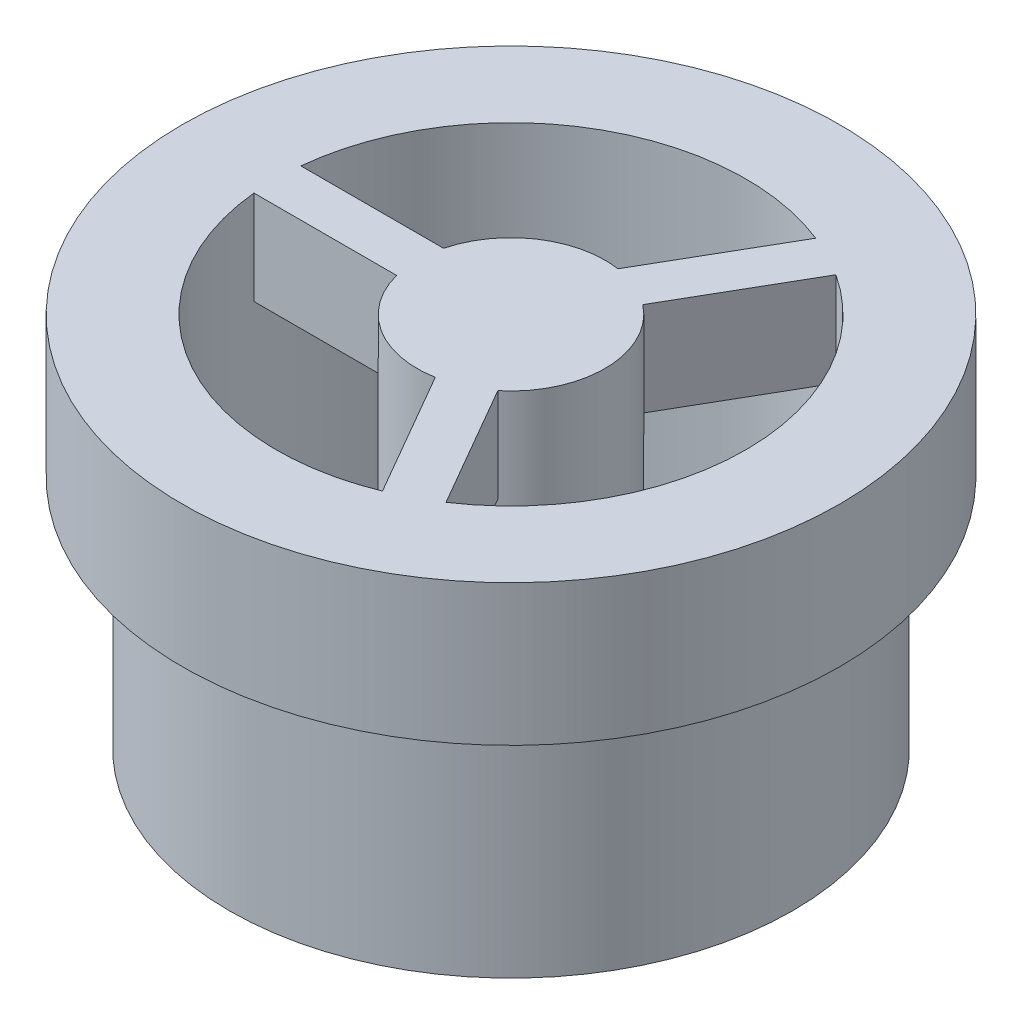
ISO-10303-21;
HEADER;
FILE_DESCRIPTION(('STEP AP214'),'2;1');
FILE_NAME('part.step','',(''),(''),'','','');
FILE_SCHEMA(('AUTOMOTIVE_DESIGN { 1 0 10303 214 1 1 1 1 }'));
ENDSEC;
DATA;
#1=APPLICATION_CONTEXT('core data for automotive mechanical design processes');
#2=APPLICATION_PROTOCOL_DEFINITION('international standard','automotive_design',2000,#1);
#3=PRODUCT_CONTEXT('',#1,'mechanical');
#4=PRODUCT('Part','Part','',(#3));
#5=PRODUCT_RELATED_PRODUCT_CATEGORY('part','',(#4));
#6=PRODUCT_DEFINITION_FORMATION('','',#4);
#7=PRODUCT_DEFINITION_CONTEXT('part definition',#1,'design');
#8=PRODUCT_DEFINITION('design','',#6,#7);
#9=PRODUCT_DEFINITION_SHAPE('','',#8);
#10=(LENGTH_UNIT() NAMED_UNIT(*) SI_UNIT(.MILLI.,.METRE.));
#11=(NAMED_UNIT(*) PLANE_ANGLE_UNIT() SI_UNIT($,.RADIAN.));
#12=(NAMED_UNIT(*) SI_UNIT($,.STERADIAN.) SOLID_ANGLE_UNIT());
#13=UNCERTAINTY_MEASURE_WITH_UNIT(LENGTH_MEASURE(1.E-05),#10,'distance_accuracy_value','');
#14=(GEOMETRIC_REPRESENTATION_CONTEXT(3) GLOBAL_UNCERTAINTY_ASSIGNED_CONTEXT((#13)) GLOBAL_UNIT_ASSIGNED_CONTEXT((#10,
#11,#12)) REPRESENTATION_CONTEXT('',''));
#15=CARTESIAN_POINT('',(0.,0.,0.));
#16=DIRECTION('',(0.,0.,1.));
#17=DIRECTION('',(1.,0.,0.));
#18=AXIS2_PLACEMENT_3D('',#15,#16,#17);
#19=CARTESIAN_POINT('',(-5.,3.,0.));
#20=DIRECTION('',(0.,-1.,0.));
#21=DIRECTION('',(1.,0.,0.));
#22=AXIS2_PLACEMENT_3D('',#19,#20,#21);
#23=PLANE('',#22);
#24=CARTESIAN_POINT('',(0.,3.,0.));
#25=DIRECTION('',(0.,-1.,0.));
#26=DIRECTION('',(0.,0.,-1.));
#27=AXIS2_PLACEMENT_3D('',#24,#25,#26);
#28=CIRCLE('',#27,2.);
#29=CARTESIAN_POINT('',(0.,3.,-2.));
#30=VERTEX_POINT('',#29);
#31=EDGE_CURVE('E118',#30,#30,#28,.F.);
#32=ORIENTED_EDGE('',*,*,#31,.F.);
#33=EDGE_LOOP('',(#32));
#34=FACE_BOUND('',#33,.T.);
#35=ADVANCED_FACE('F17',(#34),#23,.T.);
#36=CARTESIAN_POINT('',(-7.,5.,0.));
#37=DIRECTION('',(0.,-1.,0.));
#38=DIRECTION('',(1.,0.,0.));
#39=AXIS2_PLACEMENT_3D('',#36,#37,#38);
#40=PLANE('',#39);
#41=CARTESIAN_POINT('',(0.,5.,0.));
#42=DIRECTION('',(0.,1.,0.));
#43=DIRECTION('',(-1.,0.,0.));
#44=AXIS2_PLACEMENT_3D('',#41,#42,#43);
#45=CIRCLE('',#44,7.);
#46=CARTESIAN_POINT('',(-7.,5.,0.));
#47=VERTEX_POINT('',#46);
#48=EDGE_CURVE('E190',#47,#47,#45,.T.);
#49=ORIENTED_EDGE('',*,*,#48,.F.);
#50=EDGE_LOOP('',(#49));
#51=FACE_BOUND('',#50,.T.);
#52=CARTESIAN_POINT('',(0.,5.,0.));
#53=DIRECTION('',(0.,1.,0.));
#54=DIRECTION('',(-1.,0.,0.));
#55=AXIS2_PLACEMENT_3D('',#52,#53,#54);
#56=CIRCLE('',#55,6.);
#57=CARTESIAN_POINT('',(-6.,5.,0.));
#58=VERTEX_POINT('',#57);
#59=EDGE_CURVE('E129',#58,#58,#56,.F.);
#60=ORIENTED_EDGE('',*,*,#59,.F.);
#61=EDGE_LOOP('',(#60));
#62=FACE_BOUND('',#61,.T.);
#63=ADVANCED_FACE('F383',(#51,#62),#40,.T.);
#64=CARTESIAN_POINT('',(0.,6.,0.));
#65=DIRECTION('',(0.,-1.,0.));
#66=DIRECTION('',(1.,0.,0.));
#67=AXIS2_PLACEMENT_3D('',#64,#65,#66);
#68=PLANE('',#67);
#69=DIRECTION('',(0.499999999999999,0.,-0.866025403784439));
#70=VECTOR('',#69,1.);
#71=CARTESIAN_POINT('',(1.84010475798465,6.,-4.64908748892105));
#72=LINE('',#71,#70);
#73=CARTESIAN_POINT('',(0.297782593735508,6.,-1.97770713880194));
#74=VERTEX_POINT('',#73);
#75=CARTESIAN_POINT('',(1.84010475798465,6.,-4.64908748892105));
#76=VERTEX_POINT('',#75);
#77=EDGE_CURVE('E126',#74,#76,#72,.T.);
#78=ORIENTED_EDGE('',*,*,#77,.T.);
#79=CARTESIAN_POINT('',(0.,6.,0.));
#80=DIRECTION('',(0.,1.,0.));
#81=DIRECTION('',(-1.,0.,0.));
#82=AXIS2_PLACEMENT_3D('',#79,#80,#81);
#83=CIRCLE('',#82,5.);
#84=CARTESIAN_POINT('',(2.72936845702576,6.,-4.18933739698688));
#85=VERTEX_POINT('',#84);
#86=EDGE_CURVE('E20',#76,#85,#83,.F.);
#87=ORIENTED_EDGE('',*,*,#86,.T.);
#88=DIRECTION('',(-0.499999999999999,0.,0.866025403784439));
#89=VECTOR('',#88,1.);
#90=CARTESIAN_POINT('',(1.22390134225421,6.,-1.58179186507844));
#91=LINE('',#90,#89);
#92=CARTESIAN_POINT('',(1.22390134225421,6.,-1.58179186507844));
#93=VERTEX_POINT('',#92);
#94=EDGE_CURVE('E146',#85,#93,#91,.T.);
#95=ORIENTED_EDGE('',*,*,#94,.T.);
#96=CARTESIAN_POINT('',(0.,6.,0.));
#97=DIRECTION('',(0.,-1.,0.));
#98=DIRECTION('',(0.,0.,-1.));
#99=AXIS2_PLACEMENT_3D('',#96,#97,#98);
#100=CIRCLE('',#99,2.);
#101=EDGE_CURVE('E195',#74,#93,#100,.T.);
#102=ORIENTED_EDGE('',*,*,#101,.F.);
#103=EDGE_LOOP('',(#78,#87,#95,#102));
#104=FACE_BOUND('',#103,.T.);
#105=ADVANCED_FACE('F203',(#104),#68,.T.);
#106=CARTESIAN_POINT('',(0.,6.,0.));
#107=DIRECTION('',(0.,-1.,0.));
#108=DIRECTION('',(1.,0.,0.));
#109=AXIS2_PLACEMENT_3D('',#106,#107,#108);
#110=PLANE('',#109);
#111=DIRECTION('',(0.5,0.,0.866025403784439));
#112=VECTOR('',#111,1.);
#113=CARTESIAN_POINT('',(2.77500712191118,6.,4.15924698393137));
#114=LINE('',#113,#112);
#115=CARTESIAN_POINT('',(1.26707187795723,6.,1.54742652687936));
#116=VERTEX_POINT('',#115);
#117=CARTESIAN_POINT('',(2.77500712191118,6.,4.15924698393137));
#118=VERTEX_POINT('',#117);
#119=EDGE_CURVE('E150',#116,#118,#114,.T.);
#120=ORIENTED_EDGE('',*,*,#119,.T.);
#121=CARTESIAN_POINT('',(0.,6.,0.));
#122=DIRECTION('',(0.,1.,0.));
#123=DIRECTION('',(-1.,0.,0.));
#124=AXIS2_PLACEMENT_3D('',#121,#122,#123);
#125=CIRCLE('',#124,5.);
#126=CARTESIAN_POINT('',(1.89124190213249,6.,4.6285207213124));
#127=VERTEX_POINT('',#126);
#128=EDGE_CURVE('E196',#118,#127,#125,.F.);
#129=ORIENTED_EDGE('',*,*,#128,.T.);
#130=DIRECTION('',(-0.5,0.,-0.866025403784439));
#131=VECTOR('',#130,1.);
#132=CARTESIAN_POINT('',(0.355297991636209,6.,1.96818783075683));
#133=LINE('',#132,#131);
#134=CARTESIAN_POINT('',(0.355297991636209,6.,1.96818783075683));
#135=VERTEX_POINT('',#134);
#136=EDGE_CURVE('E154',#127,#135,#133,.T.);
#137=ORIENTED_EDGE('',*,*,#136,.T.);
#138=CARTESIAN_POINT('',(0.,6.,0.));
#139=DIRECTION('',(0.,-1.,0.));
#140=DIRECTION('',(0.,0.,-1.));
#141=AXIS2_PLACEMENT_3D('',#138,#139,#140);
#142=CIRCLE('',#141,2.);
#143=EDGE_CURVE('E193',#116,#135,#142,.T.);
#144=ORIENTED_EDGE('',*,*,#143,.F.);
#145=EDGE_LOOP('',(#120,#129,#137,#144));
#146=FACE_BOUND('',#145,.T.);
#147=ADVANCED_FACE('F236',(#146),#110,.T.);
#148=CARTESIAN_POINT('',(0.,6.5,0.));
#149=DIRECTION('',(0.,1.,0.));
#150=DIRECTION('',(-1.,0.,0.));
#151=AXIS2_PLACEMENT_3D('',#148,#149,#150);
#152=CYLINDRICAL_SURFACE('',#151,7.);
#153=ORIENTED_EDGE('',*,*,#48,.T.);
#154=EDGE_LOOP('',(#153));
#155=FACE_BOUND('',#154,.T.);
#156=CARTESIAN_POINT('',(0.,8.,0.));
#157=DIRECTION('',(0.,1.,0.));
#158=DIRECTION('',(-1.,0.,0.));
#159=AXIS2_PLACEMENT_3D('',#156,#157,#158);
#160=CIRCLE('',#159,7.);
#161=CARTESIAN_POINT('',(-7.,8.,0.));
#162=VERTEX_POINT('',#161);
#163=EDGE_CURVE('E141',#162,#162,#160,.T.);
#164=ORIENTED_EDGE('',*,*,#163,.F.);
#165=EDGE_LOOP('',(#164));
#166=FACE_BOUND('',#165,.T.);
#167=ADVANCED_FACE('F360',(#155,#166),#152,.T.);
#168=CARTESIAN_POINT('',(0.,6.,0.));
#169=DIRECTION('',(0.,-1.,0.));
#170=DIRECTION('',(1.,0.,0.));
#171=AXIS2_PLACEMENT_3D('',#168,#169,#170);
#172=PLANE('',#171);
#173=DIRECTION('',(1.,0.,0.));
#174=VECTOR('',#173,1.);
#175=CARTESIAN_POINT('',(-1.93649167310371,6.,-0.5));
#176=LINE('',#175,#174);
#177=CARTESIAN_POINT('',(-4.9749371855331,6.,-0.5));
#178=VERTEX_POINT('',#177);
#179=CARTESIAN_POINT('',(-1.93649167310371,6.,-0.5));
#180=VERTEX_POINT('',#179);
#181=EDGE_CURVE('E124',#178,#180,#176,.T.);
#182=ORIENTED_EDGE('',*,*,#181,.T.);
#183=CARTESIAN_POINT('',(0.,6.,0.));
#184=DIRECTION('',(0.,-1.,0.));
#185=DIRECTION('',(0.,0.,-1.));
#186=AXIS2_PLACEMENT_3D('',#183,#184,#185);
#187=CIRCLE('',#186,2.);
#188=CARTESIAN_POINT('',(-1.93649167310371,6.,0.5));
#189=VERTEX_POINT('',#188);
#190=EDGE_CURVE('E108',#189,#180,#187,.T.);
#191=ORIENTED_EDGE('',*,*,#190,.F.);
#192=DIRECTION('',(-1.,0.,0.));
#193=VECTOR('',#192,1.);
#194=CARTESIAN_POINT('',(-4.9749371855331,6.,0.500000000000001));
#195=LINE('',#194,#193);
#196=CARTESIAN_POINT('',(-4.9749371855331,6.,0.500000000000001));
#197=VERTEX_POINT('',#196);
#198=EDGE_CURVE('E140',#189,#197,#195,.T.);
#199=ORIENTED_EDGE('',*,*,#198,.T.);
#200=CARTESIAN_POINT('',(0.,6.,0.));
#201=DIRECTION('',(0.,1.,0.));
#202=DIRECTION('',(-1.,0.,0.));
#203=AXIS2_PLACEMENT_3D('',#200,#201,#202);
#204=CIRCLE('',#203,5.);
#205=EDGE_CURVE('E35',#197,#178,#204,.F.);
#206=ORIENTED_EDGE('',*,*,#205,.T.);
#207=EDGE_LOOP('',(#182,#191,#199,#206));
#208=FACE_BOUND('',#207,.T.);
#209=ADVANCED_FACE('F128',(#208),#172,.T.);
#210=CARTESIAN_POINT('',(0.,8.,0.));
#211=DIRECTION('',(0.,-1.,0.));
#212=DIRECTION('',(0.,0.,-1.));
#213=AXIS2_PLACEMENT_3D('',#210,#211,#212);
#214=CYLINDRICAL_SURFACE('',#213,2.);
#215=CARTESIAN_POINT('',(0.,8.,0.));
#216=DIRECTION('',(0.,-1.,0.));
#217=DIRECTION('',(0.,0.,-1.));
#218=AXIS2_PLACEMENT_3D('',#215,#216,#217);
#219=CIRCLE('',#218,2.);
#220=CARTESIAN_POINT('',(-1.93649167310371,8.,0.5));
#221=VERTEX_POINT('',#220);
#222=CARTESIAN_POINT('',(0.355297991636209,8.,1.96818783075683));
#223=VERTEX_POINT('',#222);
#224=EDGE_CURVE('E158',#221,#223,#219,.F.);
#225=ORIENTED_EDGE('',*,*,#224,.F.);
#226=DIRECTION('',(0.,1.,0.));
#227=VECTOR('',#226,1.);
#228=CARTESIAN_POINT('',(-1.93649167310371,8.,0.5));
#229=LINE('',#228,#227);
#230=EDGE_CURVE('E115',#221,#189,#229,.F.);
#231=ORIENTED_EDGE('',*,*,#230,.T.);
#232=ORIENTED_EDGE('',*,*,#190,.T.);
#233=DIRECTION('',(0.,1.,0.));
#234=VECTOR('',#233,1.);
#235=CARTESIAN_POINT('',(-1.93649167310371,8.,-0.5));
#236=LINE('',#235,#234);
#237=CARTESIAN_POINT('',(-1.93649167310371,8.,-0.5));
#238=VERTEX_POINT('',#237);
#239=EDGE_CURVE('E112',#180,#238,#236,.T.);
#240=ORIENTED_EDGE('',*,*,#239,.T.);
#241=CARTESIAN_POINT('',(0.,8.,0.));
#242=DIRECTION('',(0.,-1.,0.));
#243=DIRECTION('',(0.,0.,-1.));
#244=AXIS2_PLACEMENT_3D('',#241,#242,#243);
#245=CIRCLE('',#244,2.);
#246=CARTESIAN_POINT('',(0.297782593735508,8.,-1.97770713880194));
#247=VERTEX_POINT('',#246);
#248=EDGE_CURVE('E179',#247,#238,#245,.F.);
#249=ORIENTED_EDGE('',*,*,#248,.F.);
#250=DIRECTION('',(0.,1.,0.));
#251=VECTOR('',#250,1.);
#252=CARTESIAN_POINT('',(0.297782593735508,8.,-1.97770713880194));
#253=LINE('',#252,#251);
#254=EDGE_CURVE('E143',#247,#74,#253,.F.);
#255=ORIENTED_EDGE('',*,*,#254,.T.);
#256=ORIENTED_EDGE('',*,*,#101,.T.);
#257=DIRECTION('',(0.,1.,0.));
#258=VECTOR('',#257,1.);
#259=CARTESIAN_POINT('',(1.22390134225421,8.,-1.58179186507844));
#260=LINE('',#259,#258);
#261=CARTESIAN_POINT('',(1.22390134225421,8.,-1.58179186507844));
#262=VERTEX_POINT('',#261);
#263=EDGE_CURVE('E147',#93,#262,#260,.T.);
#264=ORIENTED_EDGE('',*,*,#263,.T.);
#265=CARTESIAN_POINT('',(0.,8.,0.));
#266=DIRECTION('',(0.,-1.,0.));
#267=DIRECTION('',(0.,0.,-1.));
#268=AXIS2_PLACEMENT_3D('',#265,#266,#267);
#269=CIRCLE('',#268,2.);
#270=CARTESIAN_POINT('',(1.26707187795723,8.,1.54742652687937));
#271=VERTEX_POINT('',#270);
#272=EDGE_CURVE('E181',#271,#262,#269,.F.);
#273=ORIENTED_EDGE('',*,*,#272,.F.);
#274=DIRECTION('',(0.,1.,0.));
#275=VECTOR('',#274,1.);
#276=CARTESIAN_POINT('',(1.26707187795723,8.,1.54742652687937));
#277=LINE('',#276,#275);
#278=EDGE_CURVE('E151',#271,#116,#277,.F.);
#279=ORIENTED_EDGE('',*,*,#278,.T.);
#280=ORIENTED_EDGE('',*,*,#143,.T.);
#281=DIRECTION('',(0.,1.,0.));
#282=VECTOR('',#281,1.);
#283=CARTESIAN_POINT('',(0.355297991636209,8.,1.96818783075683));
#284=LINE('',#283,#282);
#285=EDGE_CURVE('E155',#135,#223,#284,.T.);
#286=ORIENTED_EDGE('',*,*,#285,.T.);
#287=EDGE_LOOP('',(#225,#231,#232,#240,#249,#255,#256,#264,#273,#279,#280,#286));
#288=FACE_BOUND('',#287,.T.);
#289=ORIENTED_EDGE('',*,*,#31,.T.);
#290=EDGE_LOOP('',(#289));
#291=FACE_BOUND('',#290,.T.);
#292=ADVANCED_FACE('F110',(#288,#291),#214,.T.);
#293=CARTESIAN_POINT('',(0.,2.5,0.));
#294=DIRECTION('',(0.,1.,0.));
#295=DIRECTION('',(-1.,0.,0.));
#296=AXIS2_PLACEMENT_3D('',#293,#294,#295);
#297=CYLINDRICAL_SURFACE('',#296,6.);
#298=ORIENTED_EDGE('',*,*,#59,.T.);
#299=EDGE_LOOP('',(#298));
#300=FACE_BOUND('',#299,.T.);
#301=CARTESIAN_POINT('',(0.,0.,0.));
#302=DIRECTION('',(0.,1.,0.));
#303=DIRECTION('',(-1.,0.,0.));
#304=AXIS2_PLACEMENT_3D('',#301,#302,#303);
#305=CIRCLE('',#304,6.);
#306=CARTESIAN_POINT('',(-6.,0.,0.));
#307=VERTEX_POINT('',#306);
#308=EDGE_CURVE('E138',#307,#307,#305,.F.);
#309=ORIENTED_EDGE('',*,*,#308,.F.);
#310=EDGE_LOOP('',(#309));
#311=FACE_BOUND('',#310,.T.);
#312=ADVANCED_FACE('F260',(#300,#311),#297,.T.);
#313=CARTESIAN_POINT('',(-1.93649167310371,8.,-0.5));
#314=DIRECTION('',(0.,0.,1.));
#315=DIRECTION('',(1.,0.,0.));
#316=AXIS2_PLACEMENT_3D('',#313,#314,#315);
#317=PLANE('',#316);
#318=DIRECTION('',(-1.,0.,0.));
#319=VECTOR('',#318,1.);
#320=CARTESIAN_POINT('',(0.,8.,-0.5));
#321=LINE('',#320,#319);
#322=CARTESIAN_POINT('',(-4.9749371855331,8.,-0.5));
#323=VERTEX_POINT('',#322);
#324=EDGE_CURVE('E125',#238,#323,#321,.T.);
#325=ORIENTED_EDGE('',*,*,#324,.F.);
#326=ORIENTED_EDGE('',*,*,#239,.F.);
#327=ORIENTED_EDGE('',*,*,#181,.F.);
#328=DIRECTION('',(0.,1.,0.));
#329=VECTOR('',#328,1.);
#330=CARTESIAN_POINT('',(-4.9749371855331,1.5,-0.500000000000001));
#331=LINE('',#330,#329);
#332=EDGE_CURVE('E174',#178,#323,#331,.T.);
#333=ORIENTED_EDGE('',*,*,#332,.T.);
#334=EDGE_LOOP('',(#325,#326,#327,#333));
#335=FACE_BOUND('',#334,.T.);
#336=ADVANCED_FACE('F122',(#335),#317,.F.);
#337=CARTESIAN_POINT('',(1.84010475798465,8.,-4.64908748892105));
#338=DIRECTION('',(0.866025403784439,0.,0.499999999999999));
#339=DIRECTION('',(0.499999999999999,0.,-0.866025403784439));
#340=AXIS2_PLACEMENT_3D('',#337,#338,#339);
#341=PLANE('',#340);
#342=DIRECTION('',(-0.499999999999999,0.,0.866025403784439));
#343=VECTOR('',#342,1.);
#344=CARTESIAN_POINT('',(1.84010475798465,8.,-4.64908748892105));
#345=LINE('',#344,#343);
#346=CARTESIAN_POINT('',(1.84010475798465,8.,-4.64908748892105));
#347=VERTEX_POINT('',#346);
#348=EDGE_CURVE('E84',#347,#247,#345,.T.);
#349=ORIENTED_EDGE('',*,*,#348,.F.);
#350=DIRECTION('',(0.,1.,0.));
#351=VECTOR('',#350,1.);
#352=CARTESIAN_POINT('',(1.84010475798465,1.5,-4.64908748892105));
#353=LINE('',#352,#351);
#354=EDGE_CURVE('E135',#347,#76,#353,.F.);
#355=ORIENTED_EDGE('',*,*,#354,.T.);
#356=ORIENTED_EDGE('',*,*,#77,.F.);
#357=ORIENTED_EDGE('',*,*,#254,.F.);
#358=EDGE_LOOP('',(#349,#355,#356,#357));
#359=FACE_BOUND('',#358,.T.);
#360=ADVANCED_FACE('F251',(#359),#341,.F.);
#361=CARTESIAN_POINT('',(1.22390134225421,8.,-1.58179186507844));
#362=DIRECTION('',(-0.866025403784439,0.,-0.499999999999999));
#363=DIRECTION('',(-0.499999999999999,0.,0.866025403784439));
#364=AXIS2_PLACEMENT_3D('',#361,#362,#363);
#365=PLANE('',#364);
#366=DIRECTION('',(0.500000000000001,0.,-0.866025403784438));
#367=VECTOR('',#366,1.);
#368=CARTESIAN_POINT('',(1.22390134225421,8.,-1.58179186507844));
#369=LINE('',#368,#367);
#370=CARTESIAN_POINT('',(2.72936845702576,8.,-4.18933739698688));
#371=VERTEX_POINT('',#370);
#372=EDGE_CURVE('E183',#262,#371,#369,.T.);
#373=ORIENTED_EDGE('',*,*,#372,.F.);
#374=ORIENTED_EDGE('',*,*,#263,.F.);
#375=ORIENTED_EDGE('',*,*,#94,.F.);
#376=DIRECTION('',(0.,1.,0.));
#377=VECTOR('',#376,1.);
#378=CARTESIAN_POINT('',(2.72936845702576,1.5,-4.18933739698688));
#379=LINE('',#378,#377);
#380=EDGE_CURVE('E170',#85,#371,#379,.T.);
#381=ORIENTED_EDGE('',*,*,#380,.T.);
#382=EDGE_LOOP('',(#373,#374,#375,#381));
#383=FACE_BOUND('',#382,.T.);
#384=ADVANCED_FACE('F209',(#383),#365,.F.);
#385=CARTESIAN_POINT('',(2.77500712191118,8.,4.15924698393137));
#386=DIRECTION('',(-0.866025403784439,0.,0.5));
#387=DIRECTION('',(0.5,0.,0.866025403784439));
#388=AXIS2_PLACEMENT_3D('',#385,#386,#387);
#389=PLANE('',#388);
#390=DIRECTION('',(-0.500000000000001,0.,-0.866025403784438));
#391=VECTOR('',#390,1.);
#392=CARTESIAN_POINT('',(2.77500712191118,8.,4.15924698393137));
#393=LINE('',#392,#391);
#394=CARTESIAN_POINT('',(2.77500712191118,8.,4.15924698393137));
#395=VERTEX_POINT('',#394);
#396=EDGE_CURVE('E184',#395,#271,#393,.T.);
#397=ORIENTED_EDGE('',*,*,#396,.F.);
#398=DIRECTION('',(0.,1.,0.));
#399=VECTOR('',#398,1.);
#400=CARTESIAN_POINT('',(2.77500712191118,1.5,4.15924698393137));
#401=LINE('',#400,#399);
#402=EDGE_CURVE('E169',#395,#118,#401,.F.);
#403=ORIENTED_EDGE('',*,*,#402,.T.);
#404=ORIENTED_EDGE('',*,*,#119,.F.);
#405=ORIENTED_EDGE('',*,*,#278,.F.);
#406=EDGE_LOOP('',(#397,#403,#404,#405));
#407=FACE_BOUND('',#406,.T.);
#408=ADVANCED_FACE('F248',(#407),#389,.F.);
#409=CARTESIAN_POINT('',(0.355297991636209,8.,1.96818783075683));
#410=DIRECTION('',(0.866025403784439,0.,-0.5));
#411=DIRECTION('',(-0.5,0.,-0.866025403784439));
#412=AXIS2_PLACEMENT_3D('',#409,#410,#411);
#413=PLANE('',#412);
#414=DIRECTION('',(0.500000000000001,0.,0.866025403784438));
#415=VECTOR('',#414,1.);
#416=CARTESIAN_POINT('',(0.355297991636209,8.,1.96818783075683));
#417=LINE('',#416,#415);
#418=CARTESIAN_POINT('',(1.89124190213249,8.,4.6285207213124));
#419=VERTEX_POINT('',#418);
#420=EDGE_CURVE('E185',#223,#419,#417,.T.);
#421=ORIENTED_EDGE('',*,*,#420,.F.);
#422=ORIENTED_EDGE('',*,*,#285,.F.);
#423=ORIENTED_EDGE('',*,*,#136,.F.);
#424=DIRECTION('',(0.,1.,0.));
#425=VECTOR('',#424,1.);
#426=CARTESIAN_POINT('',(1.89124190213249,1.5,4.6285207213124));
#427=LINE('',#426,#425);
#428=EDGE_CURVE('E165',#127,#419,#427,.T.);
#429=ORIENTED_EDGE('',*,*,#428,.T.);
#430=EDGE_LOOP('',(#421,#422,#423,#429));
#431=FACE_BOUND('',#430,.T.);
#432=ADVANCED_FACE('F241',(#431),#413,.F.);
#433=CARTESIAN_POINT('',(0.,8.,0.));
#434=DIRECTION('',(0.,1.,0.));
#435=DIRECTION('',(-1.,0.,0.));
#436=AXIS2_PLACEMENT_3D('',#433,#434,#435);
#437=PLANE('',#436);
#438=ORIENTED_EDGE('',*,*,#163,.T.);
#439=EDGE_LOOP('',(#438));
#440=FACE_BOUND('',#439,.T.);
#441=ORIENTED_EDGE('',*,*,#248,.T.);
#442=ORIENTED_EDGE('',*,*,#324,.T.);
#443=CARTESIAN_POINT('',(0.,8.,0.));
#444=DIRECTION('',(0.,1.,0.));
#445=DIRECTION('',(-1.,0.,0.));
#446=AXIS2_PLACEMENT_3D('',#443,#444,#445);
#447=CIRCLE('',#446,5.);
#448=EDGE_CURVE('E171',#323,#347,#447,.F.);
#449=ORIENTED_EDGE('',*,*,#448,.T.);
#450=ORIENTED_EDGE('',*,*,#348,.T.);
#451=EDGE_LOOP('',(#441,#442,#449,#450));
#452=FACE_BOUND('',#451,.T.);
#453=ORIENTED_EDGE('',*,*,#272,.T.);
#454=ORIENTED_EDGE('',*,*,#372,.T.);
#455=CARTESIAN_POINT('',(0.,8.,0.));
#456=DIRECTION('',(0.,1.,0.));
#457=DIRECTION('',(-1.,0.,0.));
#458=AXIS2_PLACEMENT_3D('',#455,#456,#457);
#459=CIRCLE('',#458,5.);
#460=EDGE_CURVE('E166',#371,#395,#459,.F.);
#461=ORIENTED_EDGE('',*,*,#460,.T.);
#462=ORIENTED_EDGE('',*,*,#396,.T.);
#463=EDGE_LOOP('',(#453,#454,#461,#462));
#464=FACE_BOUND('',#463,.T.);
#465=CARTESIAN_POINT('',(0.,8.,0.));
#466=DIRECTION('',(0.,1.,0.));
#467=DIRECTION('',(-1.,0.,0.));
#468=AXIS2_PLACEMENT_3D('',#465,#466,#467);
#469=CIRCLE('',#468,5.);
#470=CARTESIAN_POINT('',(-4.9749371855331,8.,0.500000000000001));
#471=VERTEX_POINT('',#470);
#472=EDGE_CURVE('E162',#419,#471,#469,.F.);
#473=ORIENTED_EDGE('',*,*,#472,.T.);
#474=DIRECTION('',(-1.,0.,0.));
#475=VECTOR('',#474,1.);
#476=CARTESIAN_POINT('',(-4.9749371855331,8.,0.500000000000001));
#477=LINE('',#476,#475);
#478=EDGE_CURVE('E139',#471,#221,#477,.F.);
#479=ORIENTED_EDGE('',*,*,#478,.T.);
#480=ORIENTED_EDGE('',*,*,#224,.T.);
#481=ORIENTED_EDGE('',*,*,#420,.T.);
#482=EDGE_LOOP('',(#473,#479,#480,#481));
#483=FACE_BOUND('',#482,.T.);
#484=ADVANCED_FACE('F220',(#440,#452,#464,#483),#437,.T.);
#485=CARTESIAN_POINT('',(-4.9749371855331,8.,0.500000000000001));
#486=DIRECTION('',(0.,0.,-1.));
#487=DIRECTION('',(-1.,0.,0.));
#488=AXIS2_PLACEMENT_3D('',#485,#486,#487);
#489=PLANE('',#488);
#490=ORIENTED_EDGE('',*,*,#478,.F.);
#491=DIRECTION('',(0.,1.,0.));
#492=VECTOR('',#491,1.);
#493=CARTESIAN_POINT('',(-4.9749371855331,1.5,0.500000000000001));
#494=LINE('',#493,#492);
#495=EDGE_CURVE('E26',#471,#197,#494,.F.);
#496=ORIENTED_EDGE('',*,*,#495,.T.);
#497=ORIENTED_EDGE('',*,*,#198,.F.);
#498=ORIENTED_EDGE('',*,*,#230,.F.);
#499=EDGE_LOOP('',(#490,#496,#497,#498));
#500=FACE_BOUND('',#499,.T.);
#501=ADVANCED_FACE('F269',(#500),#489,.F.);
#502=CARTESIAN_POINT('',(-6.,0.,0.));
#503=DIRECTION('',(0.,-1.,0.));
#504=DIRECTION('',(1.,0.,0.));
#505=AXIS2_PLACEMENT_3D('',#502,#503,#504);
#506=PLANE('',#505);
#507=ORIENTED_EDGE('',*,*,#308,.T.);
#508=EDGE_LOOP('',(#507));
#509=FACE_BOUND('',#508,.T.);
#510=CARTESIAN_POINT('',(0.,0.,0.));
#511=DIRECTION('',(0.,1.,0.));
#512=DIRECTION('',(-1.,0.,0.));
#513=AXIS2_PLACEMENT_3D('',#510,#511,#512);
#514=CIRCLE('',#513,5.);
#515=CARTESIAN_POINT('',(-5.,0.,0.));
#516=VERTEX_POINT('',#515);
#517=EDGE_CURVE('E11',#516,#516,#514,.T.);
#518=ORIENTED_EDGE('',*,*,#517,.T.);
#519=EDGE_LOOP('',(#518));
#520=FACE_BOUND('',#519,.T.);
#521=ADVANCED_FACE('F263',(#509,#520),#506,.T.);
#522=CARTESIAN_POINT('',(0.,1.5,0.));
#523=DIRECTION('',(0.,1.,0.));
#524=DIRECTION('',(-1.,0.,0.));
#525=AXIS2_PLACEMENT_3D('',#522,#523,#524);
#526=CYLINDRICAL_SURFACE('',#525,5.);
#527=ORIENTED_EDGE('',*,*,#517,.F.);
#528=EDGE_LOOP('',(#527));
#529=FACE_BOUND('',#528,.T.);
#530=ORIENTED_EDGE('',*,*,#205,.F.);
#531=ORIENTED_EDGE('',*,*,#495,.F.);
#532=ORIENTED_EDGE('',*,*,#472,.F.);
#533=ORIENTED_EDGE('',*,*,#428,.F.);
#534=ORIENTED_EDGE('',*,*,#128,.F.);
#535=ORIENTED_EDGE('',*,*,#402,.F.);
#536=ORIENTED_EDGE('',*,*,#460,.F.);
#537=ORIENTED_EDGE('',*,*,#380,.F.);
#538=ORIENTED_EDGE('',*,*,#86,.F.);
#539=ORIENTED_EDGE('',*,*,#354,.F.);
#540=ORIENTED_EDGE('',*,*,#448,.F.);
#541=ORIENTED_EDGE('',*,*,#332,.F.);
#542=EDGE_LOOP('',(#530,#531,#532,#533,#534,#535,#536,#537,#538,#539,#540,#541));
#543=FACE_BOUND('',#542,.T.);
#544=ADVANCED_FACE('F212',(#529,#543),#526,.F.);
#545=CLOSED_SHELL('',(#35,#63,#105,#147,#167,#209,#292,#312,#336,#360,#384,#408,#432,#484,#501,
#521,#544));
#546=MANIFOLD_SOLID_BREP('B1',#545);
#547=ADVANCED_BREP_SHAPE_REPRESENTATION('',(#18,#546),#14);
#548=SHAPE_DEFINITION_REPRESENTATION(#9,#547);
ENDSEC;
END-ISO-10303-21;
